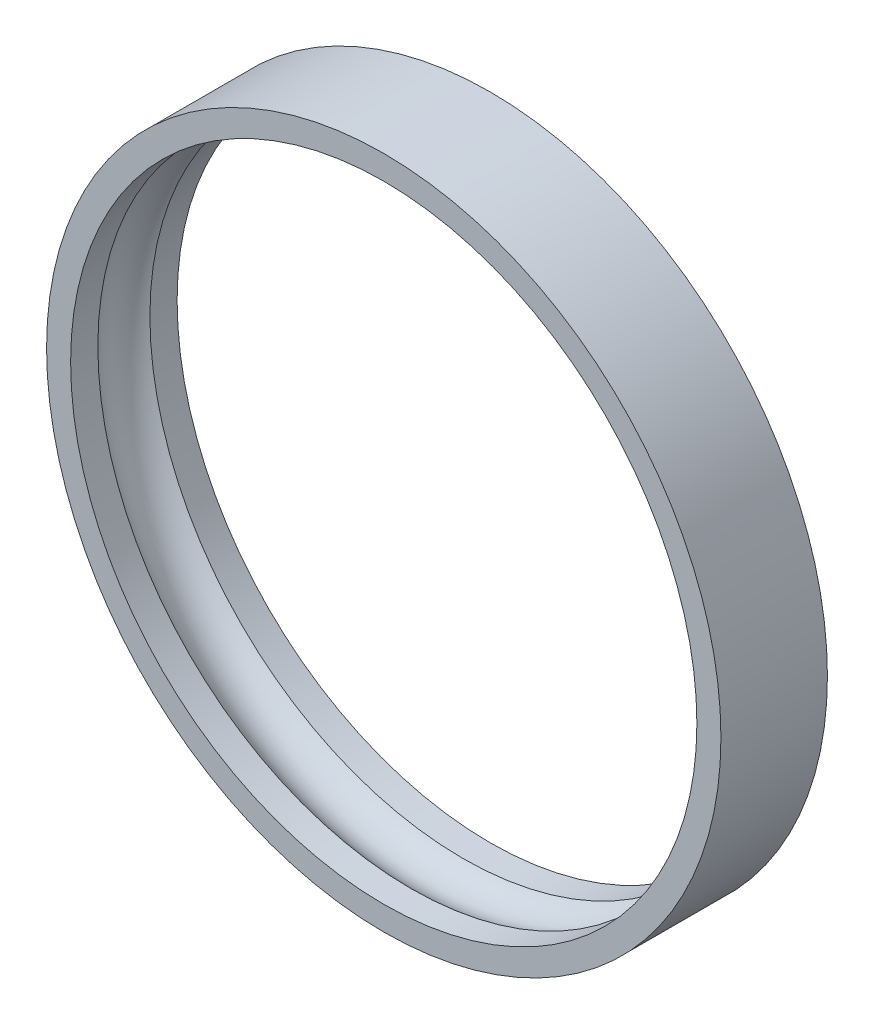
ISO-10303-21;
HEADER;
FILE_DESCRIPTION(('STEP AP214'),'2;1');
FILE_NAME('part.step','',(''),(''),'','','');
FILE_SCHEMA(('AUTOMOTIVE_DESIGN { 1 0 10303 214 1 1 1 1 }'));
ENDSEC;
DATA;
#1=APPLICATION_CONTEXT('core data for automotive mechanical design processes');
#2=APPLICATION_PROTOCOL_DEFINITION('international standard','automotive_design',2000,#1);
#3=PRODUCT_CONTEXT('',#1,'mechanical');
#4=PRODUCT('Part','Part','',(#3));
#5=PRODUCT_RELATED_PRODUCT_CATEGORY('part','',(#4));
#6=PRODUCT_DEFINITION_FORMATION('','',#4);
#7=PRODUCT_DEFINITION_CONTEXT('part definition',#1,'design');
#8=PRODUCT_DEFINITION('design','',#6,#7);
#9=PRODUCT_DEFINITION_SHAPE('','',#8);
#10=(LENGTH_UNIT() NAMED_UNIT(*) SI_UNIT(.MILLI.,.METRE.));
#11=(NAMED_UNIT(*) PLANE_ANGLE_UNIT() SI_UNIT($,.RADIAN.));
#12=(NAMED_UNIT(*) SI_UNIT($,.STERADIAN.) SOLID_ANGLE_UNIT());
#13=UNCERTAINTY_MEASURE_WITH_UNIT(LENGTH_MEASURE(1.E-05),#10,'distance_accuracy_value','');
#14=(GEOMETRIC_REPRESENTATION_CONTEXT(3) GLOBAL_UNCERTAINTY_ASSIGNED_CONTEXT((#13)) GLOBAL_UNIT_ASSIGNED_CONTEXT((#10,
#11,#12)) REPRESENTATION_CONTEXT('',''));
#15=CARTESIAN_POINT('',(0.,0.,0.));
#16=DIRECTION('',(0.,0.,1.));
#17=DIRECTION('',(1.,0.,0.));
#18=AXIS2_PLACEMENT_3D('',#15,#16,#17);
#19=CARTESIAN_POINT('',(0.,0.,3.30000000003789));
#20=DIRECTION('',(0.,0.,1.));
#21=DIRECTION('',(0.,1.,0.));
#22=AXIS2_PLACEMENT_3D('',#19,#20,#21);
#23=CYLINDRICAL_SURFACE('',#22,9.11499999999751);
#24=CARTESIAN_POINT('',(0.,0.,6.50000000003789));
#25=DIRECTION('',(0.,0.,1.));
#26=DIRECTION('',(0.,-1.,0.));
#27=AXIS2_PLACEMENT_3D('',#24,#25,#26);
#28=CIRCLE('',#27,9.11499999999751);
#29=CARTESIAN_POINT('',(0.,-9.11499999999751,6.50000000003789));
#30=VERTEX_POINT('',#29);
#31=EDGE_CURVE('E11',#30,#30,#28,.T.);
#32=ORIENTED_EDGE('',*,*,#31,.T.);
#33=EDGE_LOOP('',(#32));
#34=FACE_BOUND('',#33,.T.);
#35=CARTESIAN_POINT('',(0.,0.,5.70778872389385));
#36=DIRECTION('',(0.,0.,1.));
#37=DIRECTION('',(0.,-1.,0.));
#38=AXIS2_PLACEMENT_3D('',#35,#36,#37);
#39=CIRCLE('',#38,9.11499999999751);
#40=CARTESIAN_POINT('',(0.,-9.11499999999751,5.70778872389385));
#41=VERTEX_POINT('',#40);
#42=EDGE_CURVE('E52',#41,#41,#39,.T.);
#43=ORIENTED_EDGE('',*,*,#42,.F.);
#44=EDGE_LOOP('',(#43));
#45=FACE_BOUND('',#44,.T.);
#46=ADVANCED_FACE('F17',(#34,#45),#23,.F.);
#47=CARTESIAN_POINT('',(9.115,0.,6.50000000003789));
#48=DIRECTION('',(0.,0.,1.));
#49=DIRECTION('',(0.,1.,0.));
#50=AXIS2_PLACEMENT_3D('',#47,#48,#49);
#51=PLANE('',#50);
#52=CARTESIAN_POINT('',(0.,0.,6.50000000003789));
#53=DIRECTION('',(0.,0.,1.));
#54=DIRECTION('',(0.,-1.,0.));
#55=AXIS2_PLACEMENT_3D('',#52,#53,#54);
#56=CIRCLE('',#55,9.815);
#57=CARTESIAN_POINT('',(0.,-9.815,6.50000000003789));
#58=VERTEX_POINT('',#57);
#59=EDGE_CURVE('E28',#58,#58,#56,.T.);
#60=ORIENTED_EDGE('',*,*,#59,.T.);
#61=EDGE_LOOP('',(#60));
#62=FACE_BOUND('',#61,.T.);
#63=ORIENTED_EDGE('',*,*,#31,.F.);
#64=EDGE_LOOP('',(#63));
#65=FACE_BOUND('',#64,.T.);
#66=ADVANCED_FACE('F82',(#62,#65),#51,.T.);
#67=CARTESIAN_POINT('',(0.,0.,3.30000000003789));
#68=DIRECTION('',(0.,0.,1.));
#69=DIRECTION('',(0.,1.,0.));
#70=AXIS2_PLACEMENT_3D('',#67,#68,#69);
#71=CYLINDRICAL_SURFACE('',#70,9.815);
#72=CARTESIAN_POINT('',(0.,0.,3.40000000003789));
#73=DIRECTION('',(0.,0.,1.));
#74=DIRECTION('',(0.,-1.,0.));
#75=AXIS2_PLACEMENT_3D('',#72,#73,#74);
#76=CIRCLE('',#75,9.815);
#77=CARTESIAN_POINT('',(0.,-9.815,3.40000000003789));
#78=VERTEX_POINT('',#77);
#79=EDGE_CURVE('E57',#78,#78,#76,.T.);
#80=ORIENTED_EDGE('',*,*,#79,.T.);
#81=EDGE_LOOP('',(#80));
#82=FACE_BOUND('',#81,.T.);
#83=ORIENTED_EDGE('',*,*,#59,.F.);
#84=EDGE_LOOP('',(#83));
#85=FACE_BOUND('',#84,.T.);
#86=ADVANCED_FACE('F70',(#82,#85),#71,.T.);
#87=CARTESIAN_POINT('',(9.815,0.,3.40000000003789));
#88=DIRECTION('',(0.,0.,-1.));
#89=DIRECTION('',(0.,-1.,0.));
#90=AXIS2_PLACEMENT_3D('',#87,#88,#89);
#91=PLANE('',#90);
#92=CARTESIAN_POINT('',(0.,0.,3.40000000003788));
#93=DIRECTION('',(0.,0.,1.));
#94=DIRECTION('',(0.,-1.,0.));
#95=AXIS2_PLACEMENT_3D('',#92,#93,#94);
#96=CIRCLE('',#95,9.115);
#97=CARTESIAN_POINT('',(0.,-9.115,3.40000000003788));
#98=VERTEX_POINT('',#97);
#99=EDGE_CURVE('E46',#98,#98,#96,.T.);
#100=ORIENTED_EDGE('',*,*,#99,.T.);
#101=EDGE_LOOP('',(#100));
#102=FACE_BOUND('',#101,.T.);
#103=ORIENTED_EDGE('',*,*,#79,.F.);
#104=EDGE_LOOP('',(#103));
#105=FACE_BOUND('',#104,.T.);
#106=ADVANCED_FACE('F73',(#102,#105),#91,.T.);
#107=CARTESIAN_POINT('',(0.,0.,3.30000000003789));
#108=DIRECTION('',(0.,0.,1.));
#109=DIRECTION('',(0.,1.,0.));
#110=AXIS2_PLACEMENT_3D('',#107,#108,#109);
#111=CYLINDRICAL_SURFACE('',#110,9.115);
#112=CARTESIAN_POINT('',(0.,0.,4.19221127618358));
#113=DIRECTION('',(0.,0.,1.));
#114=DIRECTION('',(0.,-1.,0.));
#115=AXIS2_PLACEMENT_3D('',#112,#113,#114);
#116=CIRCLE('',#115,9.115);
#117=CARTESIAN_POINT('',(0.,-9.115,4.19221127618358));
#118=VERTEX_POINT('',#117);
#119=EDGE_CURVE('E21',#118,#118,#116,.T.);
#120=ORIENTED_EDGE('',*,*,#119,.T.);
#121=EDGE_LOOP('',(#120));
#122=FACE_BOUND('',#121,.T.);
#123=ORIENTED_EDGE('',*,*,#99,.F.);
#124=EDGE_LOOP('',(#123));
#125=FACE_BOUND('',#124,.T.);
#126=ADVANCED_FACE('F75',(#122,#125),#111,.F.);
#127=CARTESIAN_POINT('',(0.,0.,4.95000000003789));
#128=DIRECTION('',(0.,0.,1.));
#129=DIRECTION('',(0.,1.,0.));
#130=AXIS2_PLACEMENT_3D('',#127,#128,#129);
#131=TOROIDAL_SURFACE('',#130,8.4625,1.);
#132=ORIENTED_EDGE('',*,*,#42,.T.);
#133=EDGE_LOOP('',(#132));
#134=FACE_BOUND('',#133,.T.);
#135=ORIENTED_EDGE('',*,*,#119,.F.);
#136=EDGE_LOOP('',(#135));
#137=FACE_BOUND('',#136,.T.);
#138=ADVANCED_FACE('F19',(#134,#137),#131,.F.);
#139=CLOSED_SHELL('',(#46,#66,#86,#106,#126,#138));
#140=MANIFOLD_SOLID_BREP('B1',#139);
#141=ADVANCED_BREP_SHAPE_REPRESENTATION('',(#18,#140),#14);
#142=SHAPE_DEFINITION_REPRESENTATION(#9,#141);
ENDSEC;
END-ISO-10303-21;
